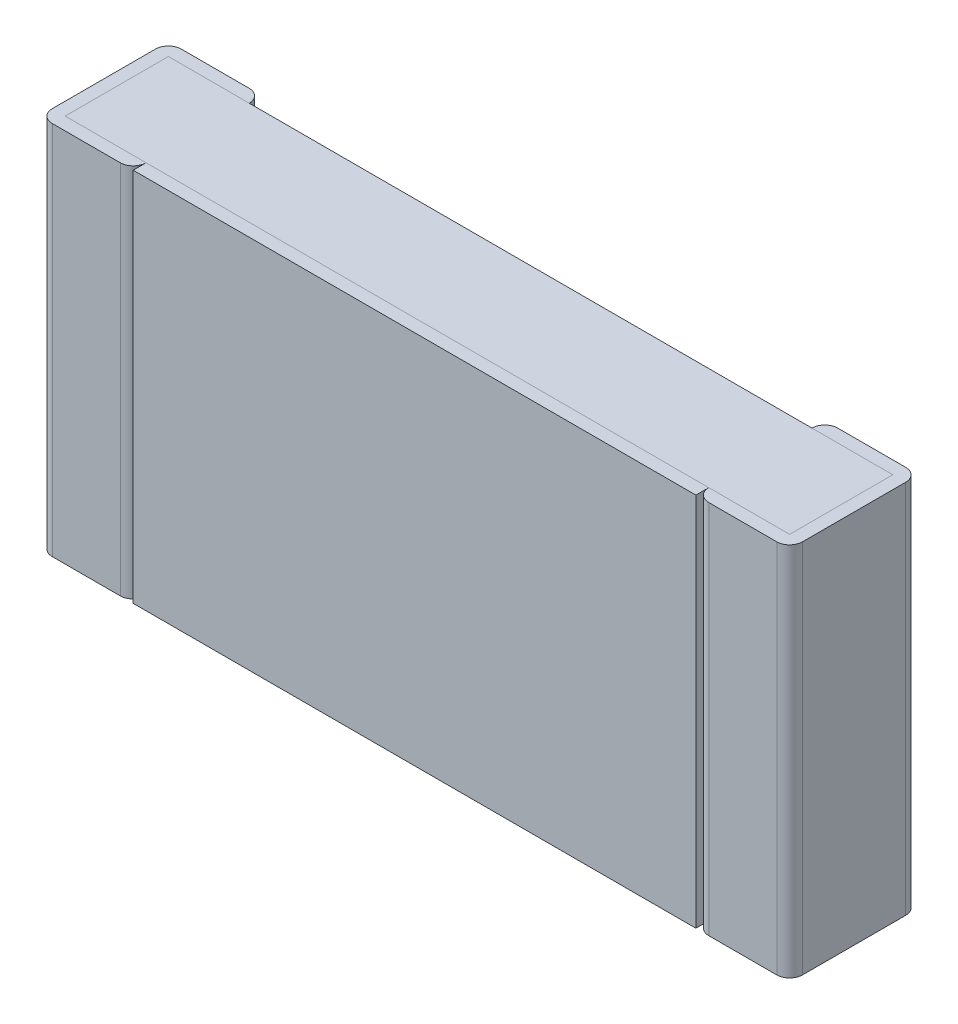
ISO-10303-21;
HEADER;
FILE_DESCRIPTION(('STEP AP214'),'2;1');
FILE_NAME('part.step','',(''),(''),'','','');
FILE_SCHEMA(('AUTOMOTIVE_DESIGN { 1 0 10303 214 1 1 1 1 }'));
ENDSEC;
DATA;
#1=APPLICATION_CONTEXT('core data for automotive mechanical design processes');
#2=APPLICATION_PROTOCOL_DEFINITION('international standard','automotive_design',2000,#1);
#3=PRODUCT_CONTEXT('',#1,'mechanical');
#4=PRODUCT('Part','Part','',(#3));
#5=PRODUCT_RELATED_PRODUCT_CATEGORY('part','',(#4));
#6=PRODUCT_DEFINITION_FORMATION('','',#4);
#7=PRODUCT_DEFINITION_CONTEXT('part definition',#1,'design');
#8=PRODUCT_DEFINITION('design','',#6,#7);
#9=PRODUCT_DEFINITION_SHAPE('','',#8);
#10=(LENGTH_UNIT() NAMED_UNIT(*) SI_UNIT(.MILLI.,.METRE.));
#11=(NAMED_UNIT(*) PLANE_ANGLE_UNIT() SI_UNIT($,.RADIAN.));
#12=(NAMED_UNIT(*) SI_UNIT($,.STERADIAN.) SOLID_ANGLE_UNIT());
#13=UNCERTAINTY_MEASURE_WITH_UNIT(LENGTH_MEASURE(1.E-05),#10,'distance_accuracy_value','');
#14=(GEOMETRIC_REPRESENTATION_CONTEXT(3) GLOBAL_UNCERTAINTY_ASSIGNED_CONTEXT((#13)) GLOBAL_UNIT_ASSIGNED_CONTEXT((#10,
#11,#12)) REPRESENTATION_CONTEXT('',''));
#15=CARTESIAN_POINT('',(0.,0.,0.));
#16=DIRECTION('',(0.,0.,1.));
#17=DIRECTION('',(1.,0.,0.));
#18=AXIS2_PLACEMENT_3D('',#15,#16,#17);
#19=CARTESIAN_POINT('',(-1.2,-0.8,0.55));
#20=DIRECTION('',(0.,0.,1.));
#21=DIRECTION('',(1.,0.,0.));
#22=AXIS2_PLACEMENT_3D('',#19,#20,#21);
#23=PLANE('',#22);
#24=DIRECTION('',(0.,1.,0.));
#25=VECTOR('',#24,1.);
#26=CARTESIAN_POINT('',(-1.2,-0.8,0.55));
#27=LINE('',#26,#25);
#28=CARTESIAN_POINT('',(-1.2,-0.8,0.55));
#29=VERTEX_POINT('',#28);
#30=CARTESIAN_POINT('',(-1.2,0.8,0.55));
#31=VERTEX_POINT('',#30);
#32=EDGE_CURVE('E260',#29,#31,#27,.T.);
#33=ORIENTED_EDGE('',*,*,#32,.F.);
#34=DIRECTION('',(1.,0.,0.));
#35=VECTOR('',#34,1.);
#36=CARTESIAN_POINT('',(-1.2,-0.8,0.55));
#37=LINE('',#36,#35);
#38=CARTESIAN_POINT('',(1.2,-0.8,0.55));
#39=VERTEX_POINT('',#38);
#40=EDGE_CURVE('E376',#29,#39,#37,.T.);
#41=ORIENTED_EDGE('',*,*,#40,.T.);
#42=DIRECTION('',(0.,1.,0.));
#43=VECTOR('',#42,1.);
#44=CARTESIAN_POINT('',(1.2,-0.8,0.55));
#45=LINE('',#44,#43);
#46=CARTESIAN_POINT('',(1.2,0.8,0.55));
#47=VERTEX_POINT('',#46);
#48=EDGE_CURVE('E11',#39,#47,#45,.T.);
#49=ORIENTED_EDGE('',*,*,#48,.T.);
#50=DIRECTION('',(1.,0.,0.));
#51=VECTOR('',#50,1.);
#52=CARTESIAN_POINT('',(-1.2,0.8,0.55));
#53=LINE('',#52,#51);
#54=EDGE_CURVE('E244',#31,#47,#53,.T.);
#55=ORIENTED_EDGE('',*,*,#54,.F.);
#56=EDGE_LOOP('',(#33,#41,#49,#55));
#57=FACE_BOUND('',#56,.T.);
#58=ADVANCED_FACE('F17',(#57),#23,.T.);
#59=CARTESIAN_POINT('',(1.2,-0.8,0.495));
#60=DIRECTION('',(1.,0.,0.));
#61=DIRECTION('',(0.,1.,0.));
#62=AXIS2_PLACEMENT_3D('',#59,#60,#61);
#63=PLANE('',#62);
#64=DIRECTION('',(0.,0.,1.));
#65=VECTOR('',#64,1.);
#66=CARTESIAN_POINT('',(1.2,-0.8,0.495));
#67=LINE('',#66,#65);
#68=CARTESIAN_POINT('',(1.2,-0.8,0.495));
#69=VERTEX_POINT('',#68);
#70=EDGE_CURVE('E370',#69,#39,#67,.T.);
#71=ORIENTED_EDGE('',*,*,#70,.F.);
#72=DIRECTION('',(0.,1.,0.));
#73=VECTOR('',#72,1.);
#74=CARTESIAN_POINT('',(1.2,-0.8,0.495));
#75=LINE('',#74,#73);
#76=CARTESIAN_POINT('',(1.2,0.8,0.495));
#77=VERTEX_POINT('',#76);
#78=EDGE_CURVE('E28',#69,#77,#75,.T.);
#79=ORIENTED_EDGE('',*,*,#78,.T.);
#80=DIRECTION('',(0.,0.,1.));
#81=VECTOR('',#80,1.);
#82=CARTESIAN_POINT('',(1.2,0.8,0.495));
#83=LINE('',#82,#81);
#84=EDGE_CURVE('E446',#77,#47,#83,.T.);
#85=ORIENTED_EDGE('',*,*,#84,.T.);
#86=ORIENTED_EDGE('',*,*,#48,.F.);
#87=EDGE_LOOP('',(#71,#79,#85,#86));
#88=FACE_BOUND('',#87,.T.);
#89=ADVANCED_FACE('F540',(#88),#63,.T.);
#90=CARTESIAN_POINT('',(1.255,-0.8,0.495));
#91=DIRECTION('',(0.,1.,0.));
#92=DIRECTION('',(-1.,0.,0.));
#93=AXIS2_PLACEMENT_3D('',#90,#91,#92);
#94=CYLINDRICAL_SURFACE('',#93,0.055);
#95=CARTESIAN_POINT('',(1.255,-0.8,0.495));
#96=DIRECTION('',(0.,1.,0.));
#97=DIRECTION('',(0.,0.,1.));
#98=AXIS2_PLACEMENT_3D('',#95,#96,#97);
#99=CIRCLE('',#98,0.055);
#100=CARTESIAN_POINT('',(1.255,-0.8,0.55));
#101=VERTEX_POINT('',#100);
#102=EDGE_CURVE('E305',#69,#101,#99,.T.);
#103=ORIENTED_EDGE('',*,*,#102,.T.);
#104=DIRECTION('',(0.,1.,0.));
#105=VECTOR('',#104,1.);
#106=CARTESIAN_POINT('',(1.255,-0.8,0.55));
#107=LINE('',#106,#105);
#108=CARTESIAN_POINT('',(1.255,0.8,0.55));
#109=VERTEX_POINT('',#108);
#110=EDGE_CURVE('E292',#101,#109,#107,.T.);
#111=ORIENTED_EDGE('',*,*,#110,.T.);
#112=CARTESIAN_POINT('',(1.255,0.8,0.495));
#113=DIRECTION('',(0.,1.,0.));
#114=DIRECTION('',(0.,0.,1.));
#115=AXIS2_PLACEMENT_3D('',#112,#113,#114);
#116=CIRCLE('',#115,0.055);
#117=EDGE_CURVE('E256',#77,#109,#116,.T.);
#118=ORIENTED_EDGE('',*,*,#117,.F.);
#119=ORIENTED_EDGE('',*,*,#78,.F.);
#120=EDGE_LOOP('',(#103,#111,#118,#119));
#121=FACE_BOUND('',#120,.T.);
#122=ADVANCED_FACE('F533',(#121),#94,.T.);
#123=CARTESIAN_POINT('',(1.2,-0.8,0.55));
#124=DIRECTION('',(0.,0.,1.));
#125=DIRECTION('',(1.,0.,0.));
#126=AXIS2_PLACEMENT_3D('',#123,#124,#125);
#127=PLANE('',#126);
#128=DIRECTION('',(1.,0.,0.));
#129=VECTOR('',#128,1.);
#130=CARTESIAN_POINT('',(1.2,0.8,0.55));
#131=LINE('',#130,#129);
#132=CARTESIAN_POINT('',(1.545,0.8,0.55));
#133=VERTEX_POINT('',#132);
#134=EDGE_CURVE('E416',#109,#133,#131,.T.);
#135=ORIENTED_EDGE('',*,*,#134,.F.);
#136=ORIENTED_EDGE('',*,*,#110,.F.);
#137=DIRECTION('',(1.,0.,0.));
#138=VECTOR('',#137,1.);
#139=CARTESIAN_POINT('',(1.2,-0.8,0.55));
#140=LINE('',#139,#138);
#141=CARTESIAN_POINT('',(1.545,-0.8,0.55));
#142=VERTEX_POINT('',#141);
#143=EDGE_CURVE('E310',#101,#142,#140,.T.);
#144=ORIENTED_EDGE('',*,*,#143,.T.);
#145=DIRECTION('',(0.,1.,0.));
#146=VECTOR('',#145,1.);
#147=CARTESIAN_POINT('',(1.545,-0.8,0.55));
#148=LINE('',#147,#146);
#149=EDGE_CURVE('E267',#142,#133,#148,.T.);
#150=ORIENTED_EDGE('',*,*,#149,.T.);
#151=EDGE_LOOP('',(#135,#136,#144,#150));
#152=FACE_BOUND('',#151,.T.);
#153=ADVANCED_FACE('F773',(#152),#127,.T.);
#154=CARTESIAN_POINT('',(1.545,-0.8,0.495));
#155=DIRECTION('',(0.,1.,0.));
#156=DIRECTION('',(1.,0.,0.));
#157=AXIS2_PLACEMENT_3D('',#154,#155,#156);
#158=CYLINDRICAL_SURFACE('',#157,0.055);
#159=DIRECTION('',(0.,1.,0.));
#160=VECTOR('',#159,1.);
#161=CARTESIAN_POINT('',(1.6,-0.8,0.495));
#162=LINE('',#161,#160);
#163=CARTESIAN_POINT('',(1.6,-0.8,0.495));
#164=VERTEX_POINT('',#163);
#165=CARTESIAN_POINT('',(1.6,0.8,0.495));
#166=VERTEX_POINT('',#165);
#167=EDGE_CURVE('E266',#164,#166,#162,.T.);
#168=ORIENTED_EDGE('',*,*,#167,.T.);
#169=CARTESIAN_POINT('',(1.545,0.8,0.495));
#170=DIRECTION('',(0.,-1.,0.));
#171=DIRECTION('',(0.,0.,1.));
#172=AXIS2_PLACEMENT_3D('',#169,#170,#171);
#173=CIRCLE('',#172,0.055);
#174=EDGE_CURVE('E21',#166,#133,#173,.T.);
#175=ORIENTED_EDGE('',*,*,#174,.T.);
#176=ORIENTED_EDGE('',*,*,#149,.F.);
#177=CARTESIAN_POINT('',(1.545,-0.8,0.495));
#178=DIRECTION('',(0.,-1.,0.));
#179=DIRECTION('',(0.,0.,1.));
#180=AXIS2_PLACEMENT_3D('',#177,#178,#179);
#181=CIRCLE('',#180,0.055);
#182=EDGE_CURVE('E306',#164,#142,#181,.T.);
#183=ORIENTED_EDGE('',*,*,#182,.F.);
#184=EDGE_LOOP('',(#168,#175,#176,#183));
#185=FACE_BOUND('',#184,.T.);
#186=ADVANCED_FACE('F777',(#185),#158,.T.);
#187=CARTESIAN_POINT('',(1.6,-0.8,0.));
#188=DIRECTION('',(1.,0.,0.));
#189=DIRECTION('',(0.,1.,0.));
#190=AXIS2_PLACEMENT_3D('',#187,#188,#189);
#191=PLANE('',#190);
#192=DIRECTION('',(0.,0.,1.));
#193=VECTOR('',#192,1.);
#194=CARTESIAN_POINT('',(1.6,-0.8,0.));
#195=LINE('',#194,#193);
#196=CARTESIAN_POINT('',(1.6,-0.8,0.055));
#197=VERTEX_POINT('',#196);
#198=EDGE_CURVE('E311',#197,#164,#195,.T.);
#199=ORIENTED_EDGE('',*,*,#198,.F.);
#200=DIRECTION('',(0.,1.,0.));
#201=VECTOR('',#200,1.);
#202=CARTESIAN_POINT('',(1.6,-0.8,0.055));
#203=LINE('',#202,#201);
#204=CARTESIAN_POINT('',(1.6,0.8,0.055));
#205=VERTEX_POINT('',#204);
#206=EDGE_CURVE('E233',#197,#205,#203,.T.);
#207=ORIENTED_EDGE('',*,*,#206,.T.);
#208=DIRECTION('',(0.,0.,1.));
#209=VECTOR('',#208,1.);
#210=CARTESIAN_POINT('',(1.6,0.8,0.));
#211=LINE('',#210,#209);
#212=EDGE_CURVE('E242',#205,#166,#211,.T.);
#213=ORIENTED_EDGE('',*,*,#212,.T.);
#214=ORIENTED_EDGE('',*,*,#167,.F.);
#215=EDGE_LOOP('',(#199,#207,#213,#214));
#216=FACE_BOUND('',#215,.T.);
#217=ADVANCED_FACE('F19',(#216),#191,.T.);
#218=CARTESIAN_POINT('',(1.545,-0.8,0.055));
#219=DIRECTION('',(0.,1.,0.));
#220=DIRECTION('',(1.,0.,0.));
#221=AXIS2_PLACEMENT_3D('',#218,#219,#220);
#222=CYLINDRICAL_SURFACE('',#221,0.055);
#223=CARTESIAN_POINT('',(1.545,-0.8,0.055));
#224=DIRECTION('',(0.,1.,0.));
#225=DIRECTION('',(0.,0.,1.));
#226=AXIS2_PLACEMENT_3D('',#223,#224,#225);
#227=CIRCLE('',#226,0.055);
#228=CARTESIAN_POINT('',(1.545,-0.8,0.));
#229=VERTEX_POINT('',#228);
#230=EDGE_CURVE('E227',#197,#229,#227,.T.);
#231=ORIENTED_EDGE('',*,*,#230,.T.);
#232=DIRECTION('',(0.,1.,0.));
#233=VECTOR('',#232,1.);
#234=CARTESIAN_POINT('',(1.545,-0.8,0.));
#235=LINE('',#234,#233);
#236=CARTESIAN_POINT('',(1.545,0.8,0.));
#237=VERTEX_POINT('',#236);
#238=EDGE_CURVE('E221',#229,#237,#235,.T.);
#239=ORIENTED_EDGE('',*,*,#238,.T.);
#240=CARTESIAN_POINT('',(1.545,0.8,0.055));
#241=DIRECTION('',(0.,1.,0.));
#242=DIRECTION('',(0.,0.,1.));
#243=AXIS2_PLACEMENT_3D('',#240,#241,#242);
#244=CIRCLE('',#243,0.055);
#245=EDGE_CURVE('E224',#205,#237,#244,.T.);
#246=ORIENTED_EDGE('',*,*,#245,.F.);
#247=ORIENTED_EDGE('',*,*,#206,.F.);
#248=EDGE_LOOP('',(#231,#239,#246,#247));
#249=FACE_BOUND('',#248,.T.);
#250=ADVANCED_FACE('F223',(#249),#222,.T.);
#251=CARTESIAN_POINT('',(1.2,-0.8,0.));
#252=DIRECTION('',(0.,0.,1.));
#253=DIRECTION('',(1.,0.,0.));
#254=AXIS2_PLACEMENT_3D('',#251,#252,#253);
#255=PLANE('',#254);
#256=ORIENTED_EDGE('',*,*,#238,.F.);
#257=DIRECTION('',(1.,0.,0.));
#258=VECTOR('',#257,1.);
#259=CARTESIAN_POINT('',(1.2,-0.8,0.));
#260=LINE('',#259,#258);
#261=CARTESIAN_POINT('',(1.255,-0.8,0.));
#262=VERTEX_POINT('',#261);
#263=EDGE_CURVE('E304',#262,#229,#260,.T.);
#264=ORIENTED_EDGE('',*,*,#263,.F.);
#265=DIRECTION('',(0.,1.,0.));
#266=VECTOR('',#265,1.);
#267=CARTESIAN_POINT('',(1.255,-0.8,0.));
#268=LINE('',#267,#266);
#269=CARTESIAN_POINT('',(1.255,0.8,0.));
#270=VERTEX_POINT('',#269);
#271=EDGE_CURVE('E234',#262,#270,#268,.T.);
#272=ORIENTED_EDGE('',*,*,#271,.T.);
#273=DIRECTION('',(1.,0.,0.));
#274=VECTOR('',#273,1.);
#275=CARTESIAN_POINT('',(1.2,0.8,0.));
#276=LINE('',#275,#274);
#277=EDGE_CURVE('E239',#270,#237,#276,.T.);
#278=ORIENTED_EDGE('',*,*,#277,.T.);
#279=EDGE_LOOP('',(#256,#264,#272,#278));
#280=FACE_BOUND('',#279,.T.);
#281=ADVANCED_FACE('F246',(#280),#255,.F.);
#282=CARTESIAN_POINT('',(1.255,-0.8,0.055));
#283=DIRECTION('',(0.,1.,0.));
#284=DIRECTION('',(-1.,0.,0.));
#285=AXIS2_PLACEMENT_3D('',#282,#283,#284);
#286=CYLINDRICAL_SURFACE('',#285,0.055);
#287=DIRECTION('',(0.,1.,0.));
#288=VECTOR('',#287,1.);
#289=CARTESIAN_POINT('',(1.2,-0.8,0.055));
#290=LINE('',#289,#288);
#291=CARTESIAN_POINT('',(1.2,-0.8,0.055));
#292=VERTEX_POINT('',#291);
#293=CARTESIAN_POINT('',(1.2,0.8,0.055));
#294=VERTEX_POINT('',#293);
#295=EDGE_CURVE('E392',#292,#294,#290,.T.);
#296=ORIENTED_EDGE('',*,*,#295,.T.);
#297=CARTESIAN_POINT('',(1.255,0.8,0.055));
#298=DIRECTION('',(0.,-1.,0.));
#299=DIRECTION('',(0.,0.,1.));
#300=AXIS2_PLACEMENT_3D('',#297,#298,#299);
#301=CIRCLE('',#300,0.055);
#302=EDGE_CURVE('E249',#294,#270,#301,.T.);
#303=ORIENTED_EDGE('',*,*,#302,.T.);
#304=ORIENTED_EDGE('',*,*,#271,.F.);
#305=CARTESIAN_POINT('',(1.255,-0.8,0.055));
#306=DIRECTION('',(0.,-1.,0.));
#307=DIRECTION('',(0.,0.,1.));
#308=AXIS2_PLACEMENT_3D('',#305,#306,#307);
#309=CIRCLE('',#308,0.055);
#310=EDGE_CURVE('E300',#292,#262,#309,.T.);
#311=ORIENTED_EDGE('',*,*,#310,.F.);
#312=EDGE_LOOP('',(#296,#303,#304,#311));
#313=FACE_BOUND('',#312,.T.);
#314=ADVANCED_FACE('F634',(#313),#286,.T.);
#315=CARTESIAN_POINT('',(-1.2,0.8,0.495));
#316=DIRECTION('',(0.,1.,0.));
#317=DIRECTION('',(1.,0.,0.));
#318=AXIS2_PLACEMENT_3D('',#315,#316,#317);
#319=PLANE('',#318);
#320=DIRECTION('',(1.,0.,0.));
#321=VECTOR('',#320,1.);
#322=CARTESIAN_POINT('',(-1.2,0.8,0.495));
#323=LINE('',#322,#321);
#324=CARTESIAN_POINT('',(-1.2,0.8,0.495));
#325=VERTEX_POINT('',#324);
#326=EDGE_CURVE('E375',#325,#77,#323,.T.);
#327=ORIENTED_EDGE('',*,*,#326,.F.);
#328=DIRECTION('',(0.,0.,1.));
#329=VECTOR('',#328,1.);
#330=CARTESIAN_POINT('',(-1.2,0.8,0.495));
#331=LINE('',#330,#329);
#332=EDGE_CURVE('E250',#325,#31,#331,.T.);
#333=ORIENTED_EDGE('',*,*,#332,.T.);
#334=ORIENTED_EDGE('',*,*,#54,.T.);
#335=ORIENTED_EDGE('',*,*,#84,.F.);
#336=EDGE_LOOP('',(#327,#333,#334,#335));
#337=FACE_BOUND('',#336,.T.);
#338=ADVANCED_FACE('F547',(#337),#319,.T.);
#339=CARTESIAN_POINT('',(1.2,0.8,0.));
#340=DIRECTION('',(0.,1.,0.));
#341=DIRECTION('',(1.,0.,0.));
#342=AXIS2_PLACEMENT_3D('',#339,#340,#341);
#343=PLANE('',#342);
#344=ORIENTED_EDGE('',*,*,#277,.F.);
#345=ORIENTED_EDGE('',*,*,#302,.F.);
#346=DIRECTION('',(1.,0.,0.));
#347=VECTOR('',#346,1.);
#348=CARTESIAN_POINT('',(-1.545,0.8,0.055));
#349=LINE('',#348,#347);
#350=CARTESIAN_POINT('',(1.545,0.8,0.055));
#351=VERTEX_POINT('',#350);
#352=EDGE_CURVE('E400',#294,#351,#349,.T.);
#353=ORIENTED_EDGE('',*,*,#352,.T.);
#354=DIRECTION('',(0.,0.,1.));
#355=VECTOR('',#354,1.);
#356=CARTESIAN_POINT('',(1.545,0.8,0.055));
#357=LINE('',#356,#355);
#358=CARTESIAN_POINT('',(1.545,0.8,0.495));
#359=VERTEX_POINT('',#358);
#360=EDGE_CURVE('E467',#351,#359,#357,.T.);
#361=ORIENTED_EDGE('',*,*,#360,.T.);
#362=DIRECTION('',(1.,0.,0.));
#363=VECTOR('',#362,1.);
#364=CARTESIAN_POINT('',(-1.545,0.8,0.495));
#365=LINE('',#364,#363);
#366=EDGE_CURVE('E430',#77,#359,#365,.T.);
#367=ORIENTED_EDGE('',*,*,#366,.F.);
#368=ORIENTED_EDGE('',*,*,#117,.T.);
#369=ORIENTED_EDGE('',*,*,#134,.T.);
#370=ORIENTED_EDGE('',*,*,#174,.F.);
#371=ORIENTED_EDGE('',*,*,#212,.F.);
#372=ORIENTED_EDGE('',*,*,#245,.T.);
#373=EDGE_LOOP('',(#344,#345,#353,#361,#367,#368,#369,#370,#371,#372));
#374=FACE_BOUND('',#373,.T.);
#375=ADVANCED_FACE('F238',(#374),#343,.T.);
#376=CARTESIAN_POINT('',(-1.2,-0.8,0.495));
#377=DIRECTION('',(1.,0.,0.));
#378=DIRECTION('',(0.,1.,0.));
#379=AXIS2_PLACEMENT_3D('',#376,#377,#378);
#380=PLANE('',#379);
#381=ORIENTED_EDGE('',*,*,#32,.T.);
#382=ORIENTED_EDGE('',*,*,#332,.F.);
#383=DIRECTION('',(0.,1.,0.));
#384=VECTOR('',#383,1.);
#385=CARTESIAN_POINT('',(-1.2,-0.8,0.495));
#386=LINE('',#385,#384);
#387=CARTESIAN_POINT('',(-1.2,-0.8,0.495));
#388=VERTEX_POINT('',#387);
#389=EDGE_CURVE('E371',#388,#325,#386,.T.);
#390=ORIENTED_EDGE('',*,*,#389,.F.);
#391=DIRECTION('',(0.,0.,1.));
#392=VECTOR('',#391,1.);
#393=CARTESIAN_POINT('',(-1.2,-0.8,0.495));
#394=LINE('',#393,#392);
#395=EDGE_CURVE('E379',#388,#29,#394,.T.);
#396=ORIENTED_EDGE('',*,*,#395,.T.);
#397=EDGE_LOOP('',(#381,#382,#390,#396));
#398=FACE_BOUND('',#397,.T.);
#399=ADVANCED_FACE('F544',(#398),#380,.F.);
#400=CARTESIAN_POINT('',(-1.2,-0.8,0.495));
#401=DIRECTION('',(0.,1.,0.));
#402=DIRECTION('',(1.,0.,0.));
#403=AXIS2_PLACEMENT_3D('',#400,#401,#402);
#404=PLANE('',#403);
#405=ORIENTED_EDGE('',*,*,#70,.T.);
#406=ORIENTED_EDGE('',*,*,#40,.F.);
#407=ORIENTED_EDGE('',*,*,#395,.F.);
#408=DIRECTION('',(1.,0.,0.));
#409=VECTOR('',#408,1.);
#410=CARTESIAN_POINT('',(-1.2,-0.8,0.495));
#411=LINE('',#410,#409);
#412=EDGE_CURVE('E322',#388,#69,#411,.T.);
#413=ORIENTED_EDGE('',*,*,#412,.T.);
#414=EDGE_LOOP('',(#405,#406,#407,#413));
#415=FACE_BOUND('',#414,.T.);
#416=ADVANCED_FACE('F542',(#415),#404,.F.);
#417=CARTESIAN_POINT('',(1.2,-0.8,0.));
#418=DIRECTION('',(0.,1.,0.));
#419=DIRECTION('',(1.,0.,0.));
#420=AXIS2_PLACEMENT_3D('',#417,#418,#419);
#421=PLANE('',#420);
#422=ORIENTED_EDGE('',*,*,#230,.F.);
#423=ORIENTED_EDGE('',*,*,#198,.T.);
#424=ORIENTED_EDGE('',*,*,#182,.T.);
#425=ORIENTED_EDGE('',*,*,#143,.F.);
#426=ORIENTED_EDGE('',*,*,#102,.F.);
#427=DIRECTION('',(1.,0.,0.));
#428=VECTOR('',#427,1.);
#429=CARTESIAN_POINT('',(-1.545,-0.8,0.495));
#430=LINE('',#429,#428);
#431=CARTESIAN_POINT('',(1.545,-0.8,0.495));
#432=VERTEX_POINT('',#431);
#433=EDGE_CURVE('E326',#69,#432,#430,.T.);
#434=ORIENTED_EDGE('',*,*,#433,.T.);
#435=DIRECTION('',(0.,0.,1.));
#436=VECTOR('',#435,1.);
#437=CARTESIAN_POINT('',(1.545,-0.8,0.055));
#438=LINE('',#437,#436);
#439=CARTESIAN_POINT('',(1.545,-0.8,0.055));
#440=VERTEX_POINT('',#439);
#441=EDGE_CURVE('E383',#440,#432,#438,.T.);
#442=ORIENTED_EDGE('',*,*,#441,.F.);
#443=DIRECTION('',(1.,0.,0.));
#444=VECTOR('',#443,1.);
#445=CARTESIAN_POINT('',(-1.545,-0.8,0.055));
#446=LINE('',#445,#444);
#447=EDGE_CURVE('E387',#292,#440,#446,.T.);
#448=ORIENTED_EDGE('',*,*,#447,.F.);
#449=ORIENTED_EDGE('',*,*,#310,.T.);
#450=ORIENTED_EDGE('',*,*,#263,.T.);
#451=EDGE_LOOP('',(#422,#423,#424,#425,#426,#434,#442,#448,#449,#450));
#452=FACE_BOUND('',#451,.T.);
#453=ADVANCED_FACE('F528',(#452),#421,.F.);
#454=CARTESIAN_POINT('',(-1.545,-0.8,0.055));
#455=DIRECTION('',(0.,0.,1.));
#456=DIRECTION('',(1.,0.,0.));
#457=AXIS2_PLACEMENT_3D('',#454,#455,#456);
#458=PLANE('',#457);
#459=DIRECTION('',(1.,0.,0.));
#460=VECTOR('',#459,1.);
#461=CARTESIAN_POINT('',(-1.545,0.8,0.055));
#462=LINE('',#461,#460);
#463=CARTESIAN_POINT('',(-1.2,0.8,0.055));
#464=VERTEX_POINT('',#463);
#465=EDGE_CURVE('E396',#464,#294,#462,.T.);
#466=ORIENTED_EDGE('',*,*,#465,.T.);
#467=ORIENTED_EDGE('',*,*,#295,.F.);
#468=DIRECTION('',(1.,0.,0.));
#469=VECTOR('',#468,1.);
#470=CARTESIAN_POINT('',(-1.545,-0.8,0.055));
#471=LINE('',#470,#469);
#472=CARTESIAN_POINT('',(-1.2,-0.8,0.055));
#473=VERTEX_POINT('',#472);
#474=EDGE_CURVE('E472',#473,#292,#471,.T.);
#475=ORIENTED_EDGE('',*,*,#474,.F.);
#476=DIRECTION('',(0.,1.,0.));
#477=VECTOR('',#476,1.);
#478=CARTESIAN_POINT('',(-1.2,-0.8,0.055));
#479=LINE('',#478,#477);
#480=EDGE_CURVE('E403',#473,#464,#479,.T.);
#481=ORIENTED_EDGE('',*,*,#480,.T.);
#482=EDGE_LOOP('',(#466,#467,#475,#481));
#483=FACE_BOUND('',#482,.T.);
#484=ADVANCED_FACE('F507',(#483),#458,.F.);
#485=CARTESIAN_POINT('',(-1.545,0.8,0.055));
#486=DIRECTION('',(0.,1.,0.));
#487=DIRECTION('',(1.,0.,0.));
#488=AXIS2_PLACEMENT_3D('',#485,#486,#487);
#489=PLANE('',#488);
#490=DIRECTION('',(1.,0.,0.));
#491=VECTOR('',#490,1.);
#492=CARTESIAN_POINT('',(-1.545,0.8,0.055));
#493=LINE('',#492,#491);
#494=CARTESIAN_POINT('',(-1.545,0.8,0.055));
#495=VERTEX_POINT('',#494);
#496=EDGE_CURVE('E391',#495,#464,#493,.T.);
#497=ORIENTED_EDGE('',*,*,#496,.F.);
#498=DIRECTION('',(0.,0.,1.));
#499=VECTOR('',#498,1.);
#500=CARTESIAN_POINT('',(-1.545,0.8,0.055));
#501=LINE('',#500,#499);
#502=CARTESIAN_POINT('',(-1.545,0.8,0.495));
#503=VERTEX_POINT('',#502);
#504=EDGE_CURVE('E388',#495,#503,#501,.T.);
#505=ORIENTED_EDGE('',*,*,#504,.T.);
#506=DIRECTION('',(1.,0.,0.));
#507=VECTOR('',#506,1.);
#508=CARTESIAN_POINT('',(-1.545,0.8,0.495));
#509=LINE('',#508,#507);
#510=EDGE_CURVE('E316',#503,#325,#509,.T.);
#511=ORIENTED_EDGE('',*,*,#510,.T.);
#512=ORIENTED_EDGE('',*,*,#326,.T.);
#513=ORIENTED_EDGE('',*,*,#366,.T.);
#514=ORIENTED_EDGE('',*,*,#360,.F.);
#515=ORIENTED_EDGE('',*,*,#352,.F.);
#516=ORIENTED_EDGE('',*,*,#465,.F.);
#517=EDGE_LOOP('',(#497,#505,#511,#512,#513,#514,#515,#516));
#518=FACE_BOUND('',#517,.T.);
#519=ADVANCED_FACE('F500',(#518),#489,.T.);
#520=CARTESIAN_POINT('',(-1.255,-0.8,0.495));
#521=DIRECTION('',(0.,1.,0.));
#522=DIRECTION('',(1.,0.,0.));
#523=AXIS2_PLACEMENT_3D('',#520,#521,#522);
#524=CYLINDRICAL_SURFACE('',#523,0.055);
#525=ORIENTED_EDGE('',*,*,#389,.T.);
#526=CARTESIAN_POINT('',(-1.255,0.8,0.495));
#527=DIRECTION('',(0.,-1.,0.));
#528=DIRECTION('',(0.,0.,1.));
#529=AXIS2_PLACEMENT_3D('',#526,#527,#528);
#530=CIRCLE('',#529,0.055);
#531=CARTESIAN_POINT('',(-1.255,0.8,0.55));
#532=VERTEX_POINT('',#531);
#533=EDGE_CURVE('E312',#325,#532,#530,.T.);
#534=ORIENTED_EDGE('',*,*,#533,.T.);
#535=DIRECTION('',(0.,1.,0.));
#536=VECTOR('',#535,1.);
#537=CARTESIAN_POINT('',(-1.255,-0.8,0.55));
#538=LINE('',#537,#536);
#539=CARTESIAN_POINT('',(-1.255,-0.8,0.55));
#540=VERTEX_POINT('',#539);
#541=EDGE_CURVE('E325',#540,#532,#538,.T.);
#542=ORIENTED_EDGE('',*,*,#541,.F.);
#543=CARTESIAN_POINT('',(-1.255,-0.8,0.495));
#544=DIRECTION('',(0.,-1.,0.));
#545=DIRECTION('',(0.,0.,1.));
#546=AXIS2_PLACEMENT_3D('',#543,#544,#545);
#547=CIRCLE('',#546,0.055);
#548=EDGE_CURVE('E294',#388,#540,#547,.T.);
#549=ORIENTED_EDGE('',*,*,#548,.F.);
#550=EDGE_LOOP('',(#525,#534,#542,#549));
#551=FACE_BOUND('',#550,.T.);
#552=ADVANCED_FACE('F515',(#551),#524,.T.);
#553=CARTESIAN_POINT('',(-1.6,-0.8,0.55));
#554=DIRECTION('',(0.,0.,1.));
#555=DIRECTION('',(1.,0.,0.));
#556=AXIS2_PLACEMENT_3D('',#553,#554,#555);
#557=PLANE('',#556);
#558=DIRECTION('',(1.,0.,0.));
#559=VECTOR('',#558,1.);
#560=CARTESIAN_POINT('',(-1.6,0.8,0.55));
#561=LINE('',#560,#559);
#562=CARTESIAN_POINT('',(-1.545,0.8,0.55));
#563=VERTEX_POINT('',#562);
#564=EDGE_CURVE('E317',#563,#532,#561,.T.);
#565=ORIENTED_EDGE('',*,*,#564,.F.);
#566=DIRECTION('',(0.,1.,0.));
#567=VECTOR('',#566,1.);
#568=CARTESIAN_POINT('',(-1.545,-0.8,0.55));
#569=LINE('',#568,#567);
#570=CARTESIAN_POINT('',(-1.545,-0.8,0.55));
#571=VERTEX_POINT('',#570);
#572=EDGE_CURVE('E285',#571,#563,#569,.T.);
#573=ORIENTED_EDGE('',*,*,#572,.F.);
#574=DIRECTION('',(1.,0.,0.));
#575=VECTOR('',#574,1.);
#576=CARTESIAN_POINT('',(-1.6,-0.8,0.55));
#577=LINE('',#576,#575);
#578=EDGE_CURVE('E298',#571,#540,#577,.T.);
#579=ORIENTED_EDGE('',*,*,#578,.T.);
#580=ORIENTED_EDGE('',*,*,#541,.T.);
#581=EDGE_LOOP('',(#565,#573,#579,#580));
#582=FACE_BOUND('',#581,.T.);
#583=ADVANCED_FACE('F519',(#582),#557,.T.);
#584=CARTESIAN_POINT('',(-1.545,-0.8,0.055));
#585=DIRECTION('',(0.,1.,0.));
#586=DIRECTION('',(1.,0.,0.));
#587=AXIS2_PLACEMENT_3D('',#584,#585,#586);
#588=PLANE('',#587);
#589=ORIENTED_EDGE('',*,*,#474,.T.);
#590=ORIENTED_EDGE('',*,*,#447,.T.);
#591=ORIENTED_EDGE('',*,*,#441,.T.);
#592=ORIENTED_EDGE('',*,*,#433,.F.);
#593=ORIENTED_EDGE('',*,*,#412,.F.);
#594=DIRECTION('',(1.,0.,0.));
#595=VECTOR('',#594,1.);
#596=CARTESIAN_POINT('',(-1.545,-0.8,0.495));
#597=LINE('',#596,#595);
#598=CARTESIAN_POINT('',(-1.545,-0.8,0.495));
#599=VERTEX_POINT('',#598);
#600=EDGE_CURVE('E299',#599,#388,#597,.T.);
#601=ORIENTED_EDGE('',*,*,#600,.F.);
#602=DIRECTION('',(0.,0.,1.));
#603=VECTOR('',#602,1.);
#604=CARTESIAN_POINT('',(-1.545,-0.8,0.055));
#605=LINE('',#604,#603);
#606=CARTESIAN_POINT('',(-1.545,-0.8,0.055));
#607=VERTEX_POINT('',#606);
#608=EDGE_CURVE('E206',#607,#599,#605,.T.);
#609=ORIENTED_EDGE('',*,*,#608,.F.);
#610=DIRECTION('',(1.,0.,0.));
#611=VECTOR('',#610,1.);
#612=CARTESIAN_POINT('',(-1.545,-0.8,0.055));
#613=LINE('',#612,#611);
#614=EDGE_CURVE('E424',#607,#473,#613,.T.);
#615=ORIENTED_EDGE('',*,*,#614,.T.);
#616=EDGE_LOOP('',(#589,#590,#591,#592,#593,#601,#609,#615));
#617=FACE_BOUND('',#616,.T.);
#618=ADVANCED_FACE('F509',(#617),#588,.F.);
#619=CARTESIAN_POINT('',(-1.255,-0.8,0.055));
#620=DIRECTION('',(0.,1.,0.));
#621=DIRECTION('',(1.,0.,0.));
#622=AXIS2_PLACEMENT_3D('',#619,#620,#621);
#623=CYLINDRICAL_SURFACE('',#622,0.055);
#624=CARTESIAN_POINT('',(-1.255,-0.8,0.055));
#625=DIRECTION('',(0.,1.,0.));
#626=DIRECTION('',(0.,0.,1.));
#627=AXIS2_PLACEMENT_3D('',#624,#625,#626);
#628=CIRCLE('',#627,0.055);
#629=CARTESIAN_POINT('',(-1.255,-0.8,0.));
#630=VERTEX_POINT('',#629);
#631=EDGE_CURVE('E279',#473,#630,#628,.T.);
#632=ORIENTED_EDGE('',*,*,#631,.T.);
#633=DIRECTION('',(0.,1.,0.));
#634=VECTOR('',#633,1.);
#635=CARTESIAN_POINT('',(-1.255,-0.8,0.));
#636=LINE('',#635,#634);
#637=CARTESIAN_POINT('',(-1.255,0.8,0.));
#638=VERTEX_POINT('',#637);
#639=EDGE_CURVE('E197',#630,#638,#636,.T.);
#640=ORIENTED_EDGE('',*,*,#639,.T.);
#641=CARTESIAN_POINT('',(-1.255,0.8,0.055));
#642=DIRECTION('',(0.,1.,0.));
#643=DIRECTION('',(0.,0.,1.));
#644=AXIS2_PLACEMENT_3D('',#641,#642,#643);
#645=CIRCLE('',#644,0.055);
#646=EDGE_CURVE('E404',#464,#638,#645,.T.);
#647=ORIENTED_EDGE('',*,*,#646,.F.);
#648=ORIENTED_EDGE('',*,*,#480,.F.);
#649=EDGE_LOOP('',(#632,#640,#647,#648));
#650=FACE_BOUND('',#649,.T.);
#651=ADVANCED_FACE('F457',(#650),#623,.T.);
#652=CARTESIAN_POINT('',(-1.6,-0.8,0.));
#653=DIRECTION('',(0.,0.,1.));
#654=DIRECTION('',(1.,0.,0.));
#655=AXIS2_PLACEMENT_3D('',#652,#653,#654);
#656=PLANE('',#655);
#657=ORIENTED_EDGE('',*,*,#639,.F.);
#658=DIRECTION('',(1.,0.,0.));
#659=VECTOR('',#658,1.);
#660=CARTESIAN_POINT('',(-1.6,-0.8,0.));
#661=LINE('',#660,#659);
#662=CARTESIAN_POINT('',(-1.545,-0.8,0.));
#663=VERTEX_POINT('',#662);
#664=EDGE_CURVE('E264',#663,#630,#661,.T.);
#665=ORIENTED_EDGE('',*,*,#664,.F.);
#666=DIRECTION('',(0.,1.,0.));
#667=VECTOR('',#666,1.);
#668=CARTESIAN_POINT('',(-1.545,-0.8,0.));
#669=LINE('',#668,#667);
#670=CARTESIAN_POINT('',(-1.545,0.8,0.));
#671=VERTEX_POINT('',#670);
#672=EDGE_CURVE('E351',#663,#671,#669,.T.);
#673=ORIENTED_EDGE('',*,*,#672,.T.);
#674=DIRECTION('',(1.,0.,0.));
#675=VECTOR('',#674,1.);
#676=CARTESIAN_POINT('',(-1.6,0.8,0.));
#677=LINE('',#676,#675);
#678=EDGE_CURVE('E284',#671,#638,#677,.T.);
#679=ORIENTED_EDGE('',*,*,#678,.T.);
#680=EDGE_LOOP('',(#657,#665,#673,#679));
#681=FACE_BOUND('',#680,.T.);
#682=ADVANCED_FACE('F705',(#681),#656,.F.);
#683=CARTESIAN_POINT('',(-1.6,0.8,0.));
#684=DIRECTION('',(0.,1.,0.));
#685=DIRECTION('',(1.,0.,0.));
#686=AXIS2_PLACEMENT_3D('',#683,#684,#685);
#687=PLANE('',#686);
#688=ORIENTED_EDGE('',*,*,#678,.F.);
#689=CARTESIAN_POINT('',(-1.545,0.8,0.055));
#690=DIRECTION('',(0.,-1.,0.));
#691=DIRECTION('',(0.,0.,1.));
#692=AXIS2_PLACEMENT_3D('',#689,#690,#691);
#693=CIRCLE('',#692,0.055);
#694=CARTESIAN_POINT('',(-1.6,0.8,0.055));
#695=VERTEX_POINT('',#694);
#696=EDGE_CURVE('E346',#695,#671,#693,.T.);
#697=ORIENTED_EDGE('',*,*,#696,.F.);
#698=DIRECTION('',(0.,0.,1.));
#699=VECTOR('',#698,1.);
#700=CARTESIAN_POINT('',(-1.6,0.8,0.));
#701=LINE('',#700,#699);
#702=CARTESIAN_POINT('',(-1.6,0.8,0.495));
#703=VERTEX_POINT('',#702);
#704=EDGE_CURVE('E269',#695,#703,#701,.T.);
#705=ORIENTED_EDGE('',*,*,#704,.T.);
#706=CARTESIAN_POINT('',(-1.545,0.8,0.495));
#707=DIRECTION('',(0.,1.,0.));
#708=DIRECTION('',(0.,0.,1.));
#709=AXIS2_PLACEMENT_3D('',#706,#707,#708);
#710=CIRCLE('',#709,0.055);
#711=EDGE_CURVE('E280',#703,#563,#710,.T.);
#712=ORIENTED_EDGE('',*,*,#711,.T.);
#713=ORIENTED_EDGE('',*,*,#564,.T.);
#714=ORIENTED_EDGE('',*,*,#533,.F.);
#715=ORIENTED_EDGE('',*,*,#510,.F.);
#716=ORIENTED_EDGE('',*,*,#504,.F.);
#717=ORIENTED_EDGE('',*,*,#496,.T.);
#718=ORIENTED_EDGE('',*,*,#646,.T.);
#719=EDGE_LOOP('',(#688,#697,#705,#712,#713,#714,#715,#716,#717,#718));
#720=FACE_BOUND('',#719,.T.);
#721=ADVANCED_FACE('F344',(#720),#687,.T.);
#722=CARTESIAN_POINT('',(-1.545,-0.8,0.495));
#723=DIRECTION('',(0.,1.,0.));
#724=DIRECTION('',(-1.,0.,0.));
#725=AXIS2_PLACEMENT_3D('',#722,#723,#724);
#726=CYLINDRICAL_SURFACE('',#725,0.055);
#727=CARTESIAN_POINT('',(-1.545,-0.8,0.495));
#728=DIRECTION('',(0.,1.,0.));
#729=DIRECTION('',(0.,0.,1.));
#730=AXIS2_PLACEMENT_3D('',#727,#728,#729);
#731=CIRCLE('',#730,0.055);
#732=CARTESIAN_POINT('',(-1.6,-0.8,0.495));
#733=VERTEX_POINT('',#732);
#734=EDGE_CURVE('E321',#733,#571,#731,.T.);
#735=ORIENTED_EDGE('',*,*,#734,.T.);
#736=ORIENTED_EDGE('',*,*,#572,.T.);
#737=ORIENTED_EDGE('',*,*,#711,.F.);
#738=DIRECTION('',(0.,1.,0.));
#739=VECTOR('',#738,1.);
#740=CARTESIAN_POINT('',(-1.6,-0.8,0.495));
#741=LINE('',#740,#739);
#742=EDGE_CURVE('E274',#733,#703,#741,.T.);
#743=ORIENTED_EDGE('',*,*,#742,.F.);
#744=EDGE_LOOP('',(#735,#736,#737,#743));
#745=FACE_BOUND('',#744,.T.);
#746=ADVANCED_FACE('F339',(#745),#726,.T.);
#747=CARTESIAN_POINT('',(-1.545,-0.8,0.055));
#748=DIRECTION('',(0.,1.,0.));
#749=DIRECTION('',(-1.,0.,0.));
#750=AXIS2_PLACEMENT_3D('',#747,#748,#749);
#751=CYLINDRICAL_SURFACE('',#750,0.055);
#752=DIRECTION('',(0.,1.,0.));
#753=VECTOR('',#752,1.);
#754=CARTESIAN_POINT('',(-1.6,-0.8,0.055));
#755=LINE('',#754,#753);
#756=CARTESIAN_POINT('',(-1.6,-0.8,0.055));
#757=VERTEX_POINT('',#756);
#758=EDGE_CURVE('E273',#757,#695,#755,.T.);
#759=ORIENTED_EDGE('',*,*,#758,.T.);
#760=ORIENTED_EDGE('',*,*,#696,.T.);
#761=ORIENTED_EDGE('',*,*,#672,.F.);
#762=CARTESIAN_POINT('',(-1.545,-0.8,0.055));
#763=DIRECTION('',(0.,-1.,0.));
#764=DIRECTION('',(0.,0.,1.));
#765=AXIS2_PLACEMENT_3D('',#762,#763,#764);
#766=CIRCLE('',#765,0.055);
#767=EDGE_CURVE('E355',#757,#663,#766,.T.);
#768=ORIENTED_EDGE('',*,*,#767,.F.);
#769=EDGE_LOOP('',(#759,#760,#761,#768));
#770=FACE_BOUND('',#769,.T.);
#771=ADVANCED_FACE('F353',(#770),#751,.T.);
#772=CARTESIAN_POINT('',(-1.6,-0.8,0.));
#773=DIRECTION('',(0.,1.,0.));
#774=DIRECTION('',(1.,0.,0.));
#775=AXIS2_PLACEMENT_3D('',#772,#773,#774);
#776=PLANE('',#775);
#777=ORIENTED_EDGE('',*,*,#631,.F.);
#778=ORIENTED_EDGE('',*,*,#614,.F.);
#779=ORIENTED_EDGE('',*,*,#608,.T.);
#780=ORIENTED_EDGE('',*,*,#600,.T.);
#781=ORIENTED_EDGE('',*,*,#548,.T.);
#782=ORIENTED_EDGE('',*,*,#578,.F.);
#783=ORIENTED_EDGE('',*,*,#734,.F.);
#784=DIRECTION('',(0.,0.,1.));
#785=VECTOR('',#784,1.);
#786=CARTESIAN_POINT('',(-1.6,-0.8,0.));
#787=LINE('',#786,#785);
#788=EDGE_CURVE('E275',#757,#733,#787,.T.);
#789=ORIENTED_EDGE('',*,*,#788,.F.);
#790=ORIENTED_EDGE('',*,*,#767,.T.);
#791=ORIENTED_EDGE('',*,*,#664,.T.);
#792=EDGE_LOOP('',(#777,#778,#779,#780,#781,#782,#783,#789,#790,#791));
#793=FACE_BOUND('',#792,.T.);
#794=ADVANCED_FACE('F360',(#793),#776,.F.);
#795=CARTESIAN_POINT('',(-1.6,-0.8,0.));
#796=DIRECTION('',(1.,0.,0.));
#797=DIRECTION('',(0.,1.,0.));
#798=AXIS2_PLACEMENT_3D('',#795,#796,#797);
#799=PLANE('',#798);
#800=ORIENTED_EDGE('',*,*,#742,.T.);
#801=ORIENTED_EDGE('',*,*,#704,.F.);
#802=ORIENTED_EDGE('',*,*,#758,.F.);
#803=ORIENTED_EDGE('',*,*,#788,.T.);
#804=EDGE_LOOP('',(#800,#801,#802,#803));
#805=FACE_BOUND('',#804,.T.);
#806=ADVANCED_FACE('F334',(#805),#799,.F.);
#807=CLOSED_SHELL('',(#58,#89,#122,#153,#186,#217,#250,#281,#314,#338,#375,#399,#416,#453,#484,
#519,#552,#583,#618,#651,#682,#721,#746,#771,#794,#806));
#808=MANIFOLD_SOLID_BREP('B1',#807);
#809=ADVANCED_BREP_SHAPE_REPRESENTATION('',(#18,#808),#14);
#810=SHAPE_DEFINITION_REPRESENTATION(#9,#809);
ENDSEC;
END-ISO-10303-21;
